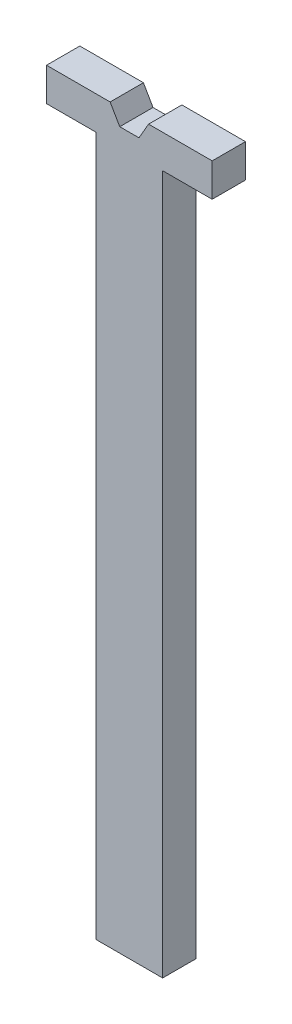
ISO-10303-21;
HEADER;
FILE_DESCRIPTION(('STEP AP214'),'2;1');
FILE_NAME('part.step','',(''),(''),'','','');
FILE_SCHEMA(('AUTOMOTIVE_DESIGN { 1 0 10303 214 1 1 1 1 }'));
ENDSEC;
DATA;
#1=APPLICATION_CONTEXT('core data for automotive mechanical design processes');
#2=APPLICATION_PROTOCOL_DEFINITION('international standard','automotive_design',2000,#1);
#3=PRODUCT_CONTEXT('',#1,'mechanical');
#4=PRODUCT('Part','Part','',(#3));
#5=PRODUCT_RELATED_PRODUCT_CATEGORY('part','',(#4));
#6=PRODUCT_DEFINITION_FORMATION('','',#4);
#7=PRODUCT_DEFINITION_CONTEXT('part definition',#1,'design');
#8=PRODUCT_DEFINITION('design','',#6,#7);
#9=PRODUCT_DEFINITION_SHAPE('','',#8);
#10=(LENGTH_UNIT() NAMED_UNIT(*) SI_UNIT(.MILLI.,.METRE.));
#11=(NAMED_UNIT(*) PLANE_ANGLE_UNIT() SI_UNIT($,.RADIAN.));
#12=(NAMED_UNIT(*) SI_UNIT($,.STERADIAN.) SOLID_ANGLE_UNIT());
#13=UNCERTAINTY_MEASURE_WITH_UNIT(LENGTH_MEASURE(1.E-05),#10,'distance_accuracy_value','');
#14=(GEOMETRIC_REPRESENTATION_CONTEXT(3) GLOBAL_UNCERTAINTY_ASSIGNED_CONTEXT((#13)) GLOBAL_UNIT_ASSIGNED_CONTEXT((#10,
#11,#12)) REPRESENTATION_CONTEXT('',''));
#15=CARTESIAN_POINT('',(0.,0.,0.));
#16=DIRECTION('',(0.,0.,1.));
#17=DIRECTION('',(1.,0.,0.));
#18=AXIS2_PLACEMENT_3D('',#15,#16,#17);
#19=CARTESIAN_POINT('',(-10.,0.,10.));
#20=DIRECTION('',(1.,0.,0.));
#21=DIRECTION('',(0.,1.,0.));
#22=AXIS2_PLACEMENT_3D('',#19,#20,#21);
#23=PLANE('',#22);
#24=DIRECTION('',(0.,-1.,0.));
#25=VECTOR('',#24,1.);
#26=CARTESIAN_POINT('',(-10.,0.,0.));
#27=LINE('',#26,#25);
#28=CARTESIAN_POINT('',(-10.,-5.,0.));
#29=VERTEX_POINT('',#28);
#30=CARTESIAN_POINT('',(-9.99999999999999,-215.,0.));
#31=VERTEX_POINT('',#30);
#32=EDGE_CURVE('E154',#29,#31,#27,.T.);
#33=ORIENTED_EDGE('',*,*,#32,.T.);
#34=DIRECTION('',(0.,0.,-1.));
#35=VECTOR('',#34,1.);
#36=CARTESIAN_POINT('',(-9.99999999999999,-215.,10.));
#37=LINE('',#36,#35);
#38=CARTESIAN_POINT('',(-9.99999999999999,-215.,10.));
#39=VERTEX_POINT('',#38);
#40=EDGE_CURVE('E11',#39,#31,#37,.T.);
#41=ORIENTED_EDGE('',*,*,#40,.F.);
#42=DIRECTION('',(0.,-1.,0.));
#43=VECTOR('',#42,1.);
#44=CARTESIAN_POINT('',(-10.,0.,10.));
#45=LINE('',#44,#43);
#46=CARTESIAN_POINT('',(-10.,-5.,10.));
#47=VERTEX_POINT('',#46);
#48=EDGE_CURVE('E183',#47,#39,#45,.T.);
#49=ORIENTED_EDGE('',*,*,#48,.F.);
#50=DIRECTION('',(0.,0.,-1.));
#51=VECTOR('',#50,1.);
#52=CARTESIAN_POINT('',(-10.,-5.,10.));
#53=LINE('',#52,#51);
#54=EDGE_CURVE('E149',#47,#29,#53,.T.);
#55=ORIENTED_EDGE('',*,*,#54,.T.);
#56=EDGE_LOOP('',(#33,#41,#49,#55));
#57=FACE_BOUND('',#56,.T.);
#58=ADVANCED_FACE('F33',(#57),#23,.F.);
#59=CARTESIAN_POINT('',(0.,-215.,10.));
#60=DIRECTION('',(0.,1.,0.));
#61=DIRECTION('',(0.,0.,1.));
#62=AXIS2_PLACEMENT_3D('',#59,#60,#61);
#63=PLANE('',#62);
#64=DIRECTION('',(1.,0.,0.));
#65=VECTOR('',#64,1.);
#66=CARTESIAN_POINT('',(0.,-215.,0.));
#67=LINE('',#66,#65);
#68=CARTESIAN_POINT('',(10.,-215.,0.));
#69=VERTEX_POINT('',#68);
#70=EDGE_CURVE('E157',#31,#69,#67,.T.);
#71=ORIENTED_EDGE('',*,*,#70,.T.);
#72=DIRECTION('',(0.,0.,-1.));
#73=VECTOR('',#72,1.);
#74=CARTESIAN_POINT('',(10.,-215.,10.));
#75=LINE('',#74,#73);
#76=CARTESIAN_POINT('',(10.,-215.,10.));
#77=VERTEX_POINT('',#76);
#78=EDGE_CURVE('E41',#77,#69,#75,.T.);
#79=ORIENTED_EDGE('',*,*,#78,.F.);
#80=DIRECTION('',(1.,0.,0.));
#81=VECTOR('',#80,1.);
#82=CARTESIAN_POINT('',(0.,-215.,10.));
#83=LINE('',#82,#81);
#84=EDGE_CURVE('E100',#39,#77,#83,.T.);
#85=ORIENTED_EDGE('',*,*,#84,.F.);
#86=ORIENTED_EDGE('',*,*,#40,.T.);
#87=EDGE_LOOP('',(#71,#79,#85,#86));
#88=FACE_BOUND('',#87,.T.);
#89=ADVANCED_FACE('F205',(#88),#63,.F.);
#90=CARTESIAN_POINT('',(10.,0.,10.));
#91=DIRECTION('',(1.,0.,0.));
#92=DIRECTION('',(0.,1.,0.));
#93=AXIS2_PLACEMENT_3D('',#90,#91,#92);
#94=PLANE('',#93);
#95=DIRECTION('',(0.,-1.,0.));
#96=VECTOR('',#95,1.);
#97=CARTESIAN_POINT('',(10.,0.,0.));
#98=LINE('',#97,#96);
#99=CARTESIAN_POINT('',(10.,-5.,0.));
#100=VERTEX_POINT('',#99);
#101=EDGE_CURVE('E160',#100,#69,#98,.T.);
#102=ORIENTED_EDGE('',*,*,#101,.F.);
#103=DIRECTION('',(0.,0.,-1.));
#104=VECTOR('',#103,1.);
#105=CARTESIAN_POINT('',(10.,-5.,10.));
#106=LINE('',#105,#104);
#107=CARTESIAN_POINT('',(10.,-5.,10.));
#108=VERTEX_POINT('',#107);
#109=EDGE_CURVE('E198',#108,#100,#106,.T.);
#110=ORIENTED_EDGE('',*,*,#109,.F.);
#111=DIRECTION('',(0.,-1.,0.));
#112=VECTOR('',#111,1.);
#113=CARTESIAN_POINT('',(10.,0.,10.));
#114=LINE('',#113,#112);
#115=EDGE_CURVE('E204',#108,#77,#114,.T.);
#116=ORIENTED_EDGE('',*,*,#115,.T.);
#117=ORIENTED_EDGE('',*,*,#78,.T.);
#118=EDGE_LOOP('',(#102,#110,#116,#117));
#119=FACE_BOUND('',#118,.T.);
#120=ADVANCED_FACE('F202',(#119),#94,.T.);
#121=CARTESIAN_POINT('',(0.,-5.,10.));
#122=DIRECTION('',(0.,1.,0.));
#123=DIRECTION('',(0.,0.,1.));
#124=AXIS2_PLACEMENT_3D('',#121,#122,#123);
#125=PLANE('',#124);
#126=DIRECTION('',(1.,0.,0.));
#127=VECTOR('',#126,1.);
#128=CARTESIAN_POINT('',(0.,-5.,0.));
#129=LINE('',#128,#127);
#130=CARTESIAN_POINT('',(24.875,-5.,0.));
#131=VERTEX_POINT('',#130);
#132=EDGE_CURVE('E163',#100,#131,#129,.T.);
#133=ORIENTED_EDGE('',*,*,#132,.T.);
#134=DIRECTION('',(0.,0.,-1.));
#135=VECTOR('',#134,1.);
#136=CARTESIAN_POINT('',(24.875,-5.,10.));
#137=LINE('',#136,#135);
#138=CARTESIAN_POINT('',(24.875,-5.,10.));
#139=VERTEX_POINT('',#138);
#140=EDGE_CURVE('E195',#139,#131,#137,.T.);
#141=ORIENTED_EDGE('',*,*,#140,.F.);
#142=DIRECTION('',(1.,0.,0.));
#143=VECTOR('',#142,1.);
#144=CARTESIAN_POINT('',(0.,-5.,10.));
#145=LINE('',#144,#143);
#146=EDGE_CURVE('E223',#108,#139,#145,.T.);
#147=ORIENTED_EDGE('',*,*,#146,.F.);
#148=ORIENTED_EDGE('',*,*,#109,.T.);
#149=EDGE_LOOP('',(#133,#141,#147,#148));
#150=FACE_BOUND('',#149,.T.);
#151=ADVANCED_FACE('F214',(#150),#125,.F.);
#152=CARTESIAN_POINT('',(24.875,0.,10.));
#153=DIRECTION('',(-1.,0.,0.));
#154=DIRECTION('',(0.,0.,1.));
#155=AXIS2_PLACEMENT_3D('',#152,#153,#154);
#156=PLANE('',#155);
#157=DIRECTION('',(0.,1.,0.));
#158=VECTOR('',#157,1.);
#159=CARTESIAN_POINT('',(24.875,0.,0.));
#160=LINE('',#159,#158);
#161=CARTESIAN_POINT('',(24.875,5.,0.));
#162=VERTEX_POINT('',#161);
#163=EDGE_CURVE('E165',#131,#162,#160,.T.);
#164=ORIENTED_EDGE('',*,*,#163,.T.);
#165=DIRECTION('',(0.,0.,-1.));
#166=VECTOR('',#165,1.);
#167=CARTESIAN_POINT('',(24.875,5.,10.));
#168=LINE('',#167,#166);
#169=CARTESIAN_POINT('',(24.875,5.,10.));
#170=VERTEX_POINT('',#169);
#171=EDGE_CURVE('E193',#170,#162,#168,.T.);
#172=ORIENTED_EDGE('',*,*,#171,.F.);
#173=DIRECTION('',(0.,1.,0.));
#174=VECTOR('',#173,1.);
#175=CARTESIAN_POINT('',(24.875,0.,10.));
#176=LINE('',#175,#174);
#177=EDGE_CURVE('E220',#139,#170,#176,.T.);
#178=ORIENTED_EDGE('',*,*,#177,.F.);
#179=ORIENTED_EDGE('',*,*,#140,.T.);
#180=EDGE_LOOP('',(#164,#172,#178,#179));
#181=FACE_BOUND('',#180,.T.);
#182=ADVANCED_FACE('F218',(#181),#156,.F.);
#183=CARTESIAN_POINT('',(0.,5.,10.));
#184=DIRECTION('',(0.,1.,0.));
#185=DIRECTION('',(0.,0.,1.));
#186=AXIS2_PLACEMENT_3D('',#183,#184,#185);
#187=PLANE('',#186);
#188=DIRECTION('',(1.,0.,0.));
#189=VECTOR('',#188,1.);
#190=CARTESIAN_POINT('',(0.,5.,0.));
#191=LINE('',#190,#189);
#192=CARTESIAN_POINT('',(5.77350269189624,5.,0.));
#193=VERTEX_POINT('',#192);
#194=EDGE_CURVE('E168',#193,#162,#191,.T.);
#195=ORIENTED_EDGE('',*,*,#194,.F.);
#196=DIRECTION('',(0.,0.,-1.));
#197=VECTOR('',#196,1.);
#198=CARTESIAN_POINT('',(5.77350269189624,5.,10.));
#199=LINE('',#198,#197);
#200=CARTESIAN_POINT('',(5.77350269189624,5.,10.));
#201=VERTEX_POINT('',#200);
#202=EDGE_CURVE('E191',#201,#193,#199,.T.);
#203=ORIENTED_EDGE('',*,*,#202,.F.);
#204=DIRECTION('',(1.,0.,0.));
#205=VECTOR('',#204,1.);
#206=CARTESIAN_POINT('',(0.,5.,10.));
#207=LINE('',#206,#205);
#208=EDGE_CURVE('E146',#201,#170,#207,.T.);
#209=ORIENTED_EDGE('',*,*,#208,.T.);
#210=ORIENTED_EDGE('',*,*,#171,.T.);
#211=EDGE_LOOP('',(#195,#203,#209,#210));
#212=FACE_BOUND('',#211,.T.);
#213=ADVANCED_FACE('F262',(#212),#187,.T.);
#214=CARTESIAN_POINT('',(2.16506350946109,-1.24999999999999,10.));
#215=DIRECTION('',(-0.866025403784439,0.5,0.));
#216=DIRECTION('',(-0.5,-0.866025403784439,0.));
#217=AXIS2_PLACEMENT_3D('',#214,#215,#216);
#218=PLANE('',#217);
#219=DIRECTION('',(0.5,0.866025403784439,0.));
#220=VECTOR('',#219,1.);
#221=CARTESIAN_POINT('',(2.16506350946109,-1.24999999999999,0.));
#222=LINE('',#221,#220);
#223=CARTESIAN_POINT('',(2.88675134594811,0.,0.));
#224=VERTEX_POINT('',#223);
#225=EDGE_CURVE('E171',#224,#193,#222,.T.);
#226=ORIENTED_EDGE('',*,*,#225,.F.);
#227=DIRECTION('',(0.,0.,-1.));
#228=VECTOR('',#227,1.);
#229=CARTESIAN_POINT('',(2.88675134594811,0.,10.));
#230=LINE('',#229,#228);
#231=CARTESIAN_POINT('',(2.88675134594811,0.,10.));
#232=VERTEX_POINT('',#231);
#233=EDGE_CURVE('E189',#232,#224,#230,.T.);
#234=ORIENTED_EDGE('',*,*,#233,.F.);
#235=DIRECTION('',(0.5,0.866025403784439,0.));
#236=VECTOR('',#235,1.);
#237=CARTESIAN_POINT('',(2.16506350946109,-1.24999999999999,10.));
#238=LINE('',#237,#236);
#239=EDGE_CURVE('E225',#232,#201,#238,.T.);
#240=ORIENTED_EDGE('',*,*,#239,.T.);
#241=ORIENTED_EDGE('',*,*,#202,.T.);
#242=EDGE_LOOP('',(#226,#234,#240,#241));
#243=FACE_BOUND('',#242,.T.);
#244=ADVANCED_FACE('F263',(#243),#218,.T.);
#245=CARTESIAN_POINT('',(0.,0.,10.));
#246=DIRECTION('',(0.,1.,0.));
#247=DIRECTION('',(-1.,0.,0.));
#248=AXIS2_PLACEMENT_3D('',#245,#246,#247);
#249=PLANE('',#248);
#250=DIRECTION('',(1.,0.,0.));
#251=VECTOR('',#250,1.);
#252=CARTESIAN_POINT('',(0.,0.,0.));
#253=LINE('',#252,#251);
#254=CARTESIAN_POINT('',(-2.88675134594815,0.,0.));
#255=VERTEX_POINT('',#254);
#256=EDGE_CURVE('E174',#255,#224,#253,.T.);
#257=ORIENTED_EDGE('',*,*,#256,.F.);
#258=DIRECTION('',(0.,0.,-1.));
#259=VECTOR('',#258,1.);
#260=CARTESIAN_POINT('',(-2.88675134594815,0.,10.));
#261=LINE('',#260,#259);
#262=CARTESIAN_POINT('',(-2.88675134594815,0.,10.));
#263=VERTEX_POINT('',#262);
#264=EDGE_CURVE('E187',#263,#255,#261,.T.);
#265=ORIENTED_EDGE('',*,*,#264,.F.);
#266=DIRECTION('',(1.,0.,0.));
#267=VECTOR('',#266,1.);
#268=CARTESIAN_POINT('',(0.,0.,10.));
#269=LINE('',#268,#267);
#270=EDGE_CURVE('E230',#263,#232,#269,.T.);
#271=ORIENTED_EDGE('',*,*,#270,.T.);
#272=ORIENTED_EDGE('',*,*,#233,.T.);
#273=EDGE_LOOP('',(#257,#265,#271,#272));
#274=FACE_BOUND('',#273,.T.);
#275=ADVANCED_FACE('F266',(#274),#249,.T.);
#276=CARTESIAN_POINT('',(-2.16506350946111,-1.25000000000001,10.));
#277=DIRECTION('',(0.866025403784439,0.5,0.));
#278=DIRECTION('',(-0.5,0.866025403784439,0.));
#279=AXIS2_PLACEMENT_3D('',#276,#277,#278);
#280=PLANE('',#279);
#281=DIRECTION('',(0.5,-0.866025403784439,0.));
#282=VECTOR('',#281,1.);
#283=CARTESIAN_POINT('',(-2.16506350946111,-1.25000000000001,0.));
#284=LINE('',#283,#282);
#285=CARTESIAN_POINT('',(-5.77350269189628,5.,0.));
#286=VERTEX_POINT('',#285);
#287=EDGE_CURVE('E177',#286,#255,#284,.T.);
#288=ORIENTED_EDGE('',*,*,#287,.F.);
#289=DIRECTION('',(0.,0.,-1.));
#290=VECTOR('',#289,1.);
#291=CARTESIAN_POINT('',(-5.77350269189628,5.,10.));
#292=LINE('',#291,#290);
#293=CARTESIAN_POINT('',(-5.77350269189628,5.,10.));
#294=VERTEX_POINT('',#293);
#295=EDGE_CURVE('E137',#294,#286,#292,.T.);
#296=ORIENTED_EDGE('',*,*,#295,.F.);
#297=DIRECTION('',(0.5,-0.866025403784439,0.));
#298=VECTOR('',#297,1.);
#299=CARTESIAN_POINT('',(-2.16506350946111,-1.25000000000001,10.));
#300=LINE('',#299,#298);
#301=EDGE_CURVE('E144',#294,#263,#300,.T.);
#302=ORIENTED_EDGE('',*,*,#301,.T.);
#303=ORIENTED_EDGE('',*,*,#264,.T.);
#304=EDGE_LOOP('',(#288,#296,#302,#303));
#305=FACE_BOUND('',#304,.T.);
#306=ADVANCED_FACE('F235',(#305),#280,.T.);
#307=CARTESIAN_POINT('',(-24.875,5.,0.));
#308=VERTEX_POINT('',#307);
#309=EDGE_CURVE('E132',#308,#286,#191,.T.);
#310=ORIENTED_EDGE('',*,*,#309,.F.);
#311=DIRECTION('',(0.,0.,-1.));
#312=VECTOR('',#311,1.);
#313=CARTESIAN_POINT('',(-24.875,5.,10.));
#314=LINE('',#313,#312);
#315=CARTESIAN_POINT('',(-24.875,5.,10.));
#316=VERTEX_POINT('',#315);
#317=EDGE_CURVE('E127',#316,#308,#314,.T.);
#318=ORIENTED_EDGE('',*,*,#317,.F.);
#319=EDGE_CURVE('E130',#316,#294,#207,.T.);
#320=ORIENTED_EDGE('',*,*,#319,.T.);
#321=ORIENTED_EDGE('',*,*,#295,.T.);
#322=EDGE_LOOP('',(#310,#318,#320,#321));
#323=FACE_BOUND('',#322,.T.);
#324=ADVANCED_FACE('F129',(#323),#187,.T.);
#325=CARTESIAN_POINT('',(-24.875,0.,10.));
#326=DIRECTION('',(-1.,0.,0.));
#327=DIRECTION('',(0.,0.,1.));
#328=AXIS2_PLACEMENT_3D('',#325,#326,#327);
#329=PLANE('',#328);
#330=DIRECTION('',(0.,1.,0.));
#331=VECTOR('',#330,1.);
#332=CARTESIAN_POINT('',(-24.875,0.,0.));
#333=LINE('',#332,#331);
#334=CARTESIAN_POINT('',(-24.875,-5.,0.));
#335=VERTEX_POINT('',#334);
#336=EDGE_CURVE('E180',#335,#308,#333,.T.);
#337=ORIENTED_EDGE('',*,*,#336,.F.);
#338=DIRECTION('',(0.,0.,-1.));
#339=VECTOR('',#338,1.);
#340=CARTESIAN_POINT('',(-24.875,-5.,10.));
#341=LINE('',#340,#339);
#342=CARTESIAN_POINT('',(-24.875,-5.,10.));
#343=VERTEX_POINT('',#342);
#344=EDGE_CURVE('E89',#343,#335,#341,.T.);
#345=ORIENTED_EDGE('',*,*,#344,.F.);
#346=DIRECTION('',(0.,1.,0.));
#347=VECTOR('',#346,1.);
#348=CARTESIAN_POINT('',(-24.875,0.,10.));
#349=LINE('',#348,#347);
#350=EDGE_CURVE('E141',#343,#316,#349,.T.);
#351=ORIENTED_EDGE('',*,*,#350,.T.);
#352=ORIENTED_EDGE('',*,*,#317,.T.);
#353=EDGE_LOOP('',(#337,#345,#351,#352));
#354=FACE_BOUND('',#353,.T.);
#355=ADVANCED_FACE('F147',(#354),#329,.T.);
#356=CARTESIAN_POINT('',(0.,-5.,10.));
#357=DIRECTION('',(0.,1.,0.));
#358=DIRECTION('',(0.,0.,1.));
#359=AXIS2_PLACEMENT_3D('',#356,#357,#358);
#360=PLANE('',#359);
#361=DIRECTION('',(1.,0.,0.));
#362=VECTOR('',#361,1.);
#363=CARTESIAN_POINT('',(0.,-5.,0.));
#364=LINE('',#363,#362);
#365=EDGE_CURVE('E92',#335,#29,#364,.T.);
#366=ORIENTED_EDGE('',*,*,#365,.T.);
#367=ORIENTED_EDGE('',*,*,#54,.F.);
#368=DIRECTION('',(1.,0.,0.));
#369=VECTOR('',#368,1.);
#370=CARTESIAN_POINT('',(0.,-5.,10.));
#371=LINE('',#370,#369);
#372=EDGE_CURVE('E49',#343,#47,#371,.T.);
#373=ORIENTED_EDGE('',*,*,#372,.F.);
#374=ORIENTED_EDGE('',*,*,#344,.T.);
#375=EDGE_LOOP('',(#366,#367,#373,#374));
#376=FACE_BOUND('',#375,.T.);
#377=ADVANCED_FACE('F239',(#376),#360,.F.);
#378=CARTESIAN_POINT('',(0.,0.,10.));
#379=DIRECTION('',(0.,0.,1.));
#380=DIRECTION('',(1.,0.,0.));
#381=AXIS2_PLACEMENT_3D('',#378,#379,#380);
#382=PLANE('',#381);
#383=ORIENTED_EDGE('',*,*,#48,.T.);
#384=ORIENTED_EDGE('',*,*,#84,.T.);
#385=ORIENTED_EDGE('',*,*,#115,.F.);
#386=ORIENTED_EDGE('',*,*,#146,.T.);
#387=ORIENTED_EDGE('',*,*,#177,.T.);
#388=ORIENTED_EDGE('',*,*,#208,.F.);
#389=ORIENTED_EDGE('',*,*,#239,.F.);
#390=ORIENTED_EDGE('',*,*,#270,.F.);
#391=ORIENTED_EDGE('',*,*,#301,.F.);
#392=ORIENTED_EDGE('',*,*,#319,.F.);
#393=ORIENTED_EDGE('',*,*,#350,.F.);
#394=ORIENTED_EDGE('',*,*,#372,.T.);
#395=EDGE_LOOP('',(#383,#384,#385,#386,#387,#388,#389,#390,#391,#392,#393,#394));
#396=FACE_BOUND('',#395,.T.);
#397=ADVANCED_FACE('F140',(#396),#382,.T.);
#398=CARTESIAN_POINT('',(0.,0.,0.));
#399=DIRECTION('',(0.,0.,1.));
#400=DIRECTION('',(1.,0.,0.));
#401=AXIS2_PLACEMENT_3D('',#398,#399,#400);
#402=PLANE('',#401);
#403=ORIENTED_EDGE('',*,*,#32,.F.);
#404=ORIENTED_EDGE('',*,*,#365,.F.);
#405=ORIENTED_EDGE('',*,*,#336,.T.);
#406=ORIENTED_EDGE('',*,*,#309,.T.);
#407=ORIENTED_EDGE('',*,*,#287,.T.);
#408=ORIENTED_EDGE('',*,*,#256,.T.);
#409=ORIENTED_EDGE('',*,*,#225,.T.);
#410=ORIENTED_EDGE('',*,*,#194,.T.);
#411=ORIENTED_EDGE('',*,*,#163,.F.);
#412=ORIENTED_EDGE('',*,*,#132,.F.);
#413=ORIENTED_EDGE('',*,*,#101,.T.);
#414=ORIENTED_EDGE('',*,*,#70,.F.);
#415=EDGE_LOOP('',(#403,#404,#405,#406,#407,#408,#409,#410,#411,#412,#413,#414));
#416=FACE_BOUND('',#415,.T.);
#417=ADVANCED_FACE('F210',(#416),#402,.F.);
#418=CLOSED_SHELL('',(#58,#89,#120,#151,#182,#213,#244,#275,#306,#324,#355,#377,#397,#417));
#419=MANIFOLD_SOLID_BREP('B2',#418);
#420=ADVANCED_BREP_SHAPE_REPRESENTATION('',(#18,#419),#14);
#421=SHAPE_DEFINITION_REPRESENTATION(#9,#420);
ENDSEC;
END-ISO-10303-21;
